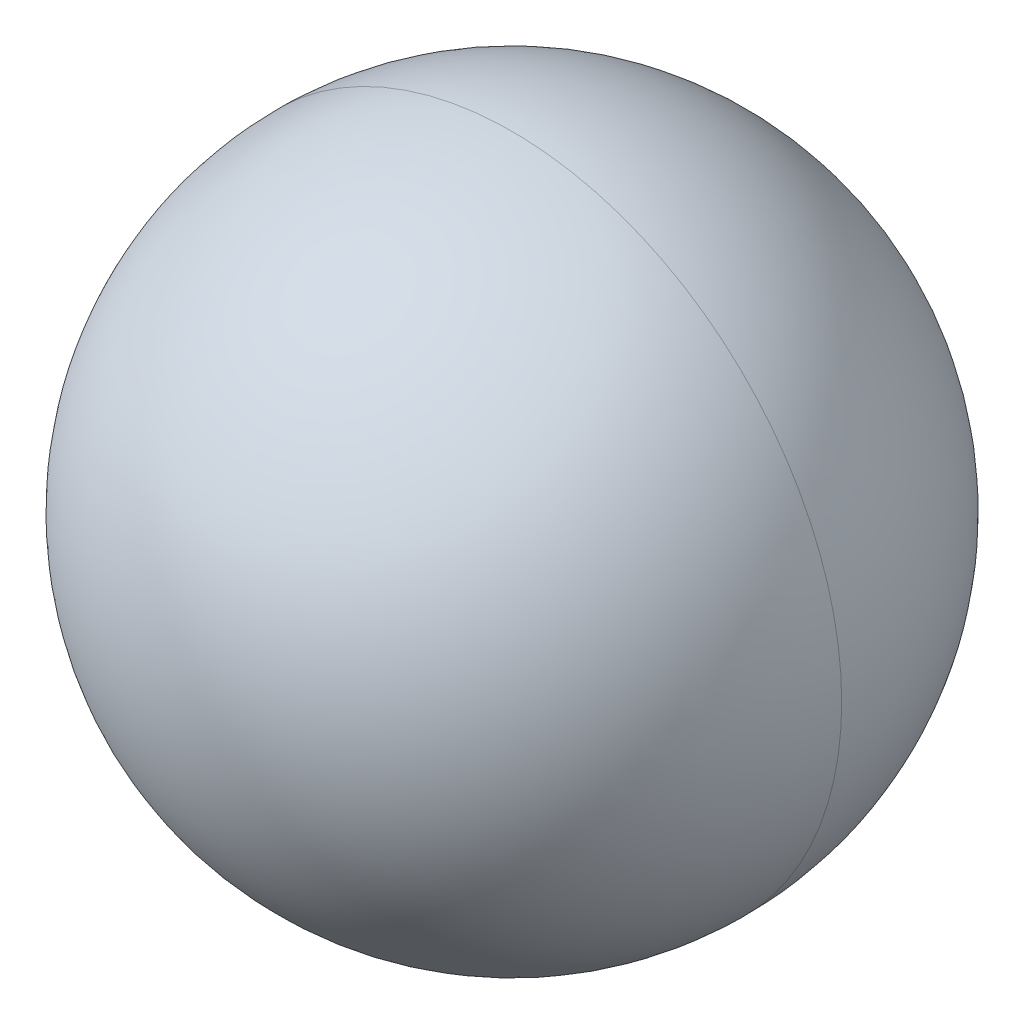
ISO-10303-21;
HEADER;
FILE_DESCRIPTION(('STEP AP214'),'2;1');
FILE_NAME('part.step','',(''),(''),'','','');
FILE_SCHEMA(('AUTOMOTIVE_DESIGN { 1 0 10303 214 1 1 1 1 }'));
ENDSEC;
DATA;
#1=APPLICATION_CONTEXT('core data for automotive mechanical design processes');
#2=APPLICATION_PROTOCOL_DEFINITION('international standard','automotive_design',2000,#1);
#3=PRODUCT_CONTEXT('',#1,'mechanical');
#4=PRODUCT('Part','Part','',(#3));
#5=PRODUCT_RELATED_PRODUCT_CATEGORY('part','',(#4));
#6=PRODUCT_DEFINITION_FORMATION('','',#4);
#7=PRODUCT_DEFINITION_CONTEXT('part definition',#1,'design');
#8=PRODUCT_DEFINITION('design','',#6,#7);
#9=PRODUCT_DEFINITION_SHAPE('','',#8);
#10=(LENGTH_UNIT() NAMED_UNIT(*) SI_UNIT(.MILLI.,.METRE.));
#11=(NAMED_UNIT(*) PLANE_ANGLE_UNIT() SI_UNIT($,.RADIAN.));
#12=(NAMED_UNIT(*) SI_UNIT($,.STERADIAN.) SOLID_ANGLE_UNIT());
#13=UNCERTAINTY_MEASURE_WITH_UNIT(LENGTH_MEASURE(1.E-05),#10,'distance_accuracy_value','');
#14=(GEOMETRIC_REPRESENTATION_CONTEXT(3) GLOBAL_UNCERTAINTY_ASSIGNED_CONTEXT((#13)) GLOBAL_UNIT_ASSIGNED_CONTEXT((#10,
#11,#12)) REPRESENTATION_CONTEXT('',''));
#15=CARTESIAN_POINT('',(0.,0.,0.));
#16=DIRECTION('',(0.,0.,1.));
#17=DIRECTION('',(1.,0.,0.));
#18=AXIS2_PLACEMENT_3D('',#15,#16,#17);
#19=CARTESIAN_POINT('',(3.5,22.75,0.));
#20=DIRECTION('',(1.,0.,0.));
#21=DIRECTION('',(0.,0.,-1.));
#22=AXIS2_PLACEMENT_3D('',#19,#20,#21);
#23=SPHERICAL_SURFACE('',#22,1.75);
#24=CARTESIAN_POINT('',(3.5,22.75,0.));
#25=DIRECTION('',(0.,0.,1.));
#26=DIRECTION('',(1.,0.,0.));
#27=AXIS2_PLACEMENT_3D('',#24,#25,#26);
#28=CIRCLE('',#27,1.75);
#29=CARTESIAN_POINT('',(5.25,22.75,0.));
#30=VERTEX_POINT('',#29);
#31=CARTESIAN_POINT('',(1.75,22.75,0.));
#32=VERTEX_POINT('',#31);
#33=EDGE_CURVE('E11',#30,#32,#28,.T.);
#34=ORIENTED_EDGE('',*,*,#33,.T.);
#35=CARTESIAN_POINT('',(3.5,22.75,0.));
#36=DIRECTION('',(0.,0.,-1.));
#37=DIRECTION('',(1.,0.,0.));
#38=AXIS2_PLACEMENT_3D('',#35,#36,#37);
#39=CIRCLE('',#38,1.75);
#40=EDGE_CURVE('E25',#30,#32,#39,.T.);
#41=ORIENTED_EDGE('',*,*,#40,.F.);
#42=EDGE_LOOP('',(#34,#41));
#43=FACE_BOUND('',#42,.T.);
#44=ADVANCED_FACE('F17',(#43),#23,.T.);
#45=CARTESIAN_POINT('',(3.5,22.75,0.));
#46=DIRECTION('',(1.,0.,0.));
#47=DIRECTION('',(0.,0.,1.));
#48=AXIS2_PLACEMENT_3D('',#45,#46,#47);
#49=SPHERICAL_SURFACE('',#48,1.75);
#50=ORIENTED_EDGE('',*,*,#33,.F.);
#51=ORIENTED_EDGE('',*,*,#40,.T.);
#52=EDGE_LOOP('',(#50,#51));
#53=FACE_BOUND('',#52,.T.);
#54=ADVANCED_FACE('F33',(#53),#49,.T.);
#55=CLOSED_SHELL('',(#44,#54));
#56=MANIFOLD_SOLID_BREP('B1',#55);
#57=ADVANCED_BREP_SHAPE_REPRESENTATION('',(#18,#56),#14);
#58=SHAPE_DEFINITION_REPRESENTATION(#9,#57);
ENDSEC;
END-ISO-10303-21;
